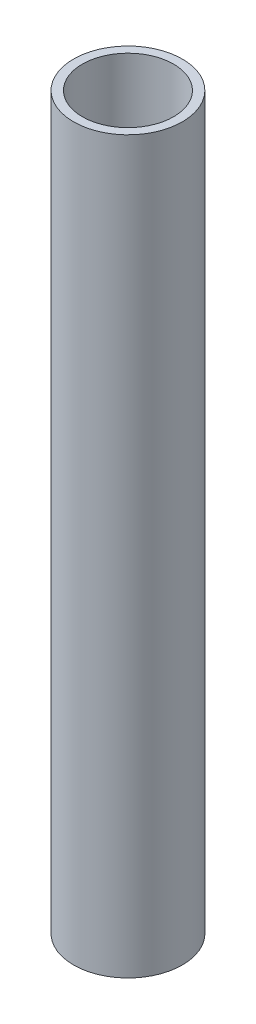
ISO-10303-21;
HEADER;
FILE_DESCRIPTION(('STEP AP214'),'2;1');
FILE_NAME('part.step','',(''),(''),'','','');
FILE_SCHEMA(('AUTOMOTIVE_DESIGN { 1 0 10303 214 1 1 1 1 }'));
ENDSEC;
DATA;
#1=APPLICATION_CONTEXT('core data for automotive mechanical design processes');
#2=APPLICATION_PROTOCOL_DEFINITION('international standard','automotive_design',2000,#1);
#3=PRODUCT_CONTEXT('',#1,'mechanical');
#4=PRODUCT('Part','Part','',(#3));
#5=PRODUCT_RELATED_PRODUCT_CATEGORY('part','',(#4));
#6=PRODUCT_DEFINITION_FORMATION('','',#4);
#7=PRODUCT_DEFINITION_CONTEXT('part definition',#1,'design');
#8=PRODUCT_DEFINITION('design','',#6,#7);
#9=PRODUCT_DEFINITION_SHAPE('','',#8);
#10=(LENGTH_UNIT() NAMED_UNIT(*) SI_UNIT(.MILLI.,.METRE.));
#11=(NAMED_UNIT(*) PLANE_ANGLE_UNIT() SI_UNIT($,.RADIAN.));
#12=(NAMED_UNIT(*) SI_UNIT($,.STERADIAN.) SOLID_ANGLE_UNIT());
#13=UNCERTAINTY_MEASURE_WITH_UNIT(LENGTH_MEASURE(1.E-05),#10,'distance_accuracy_value','');
#14=(GEOMETRIC_REPRESENTATION_CONTEXT(3) GLOBAL_UNCERTAINTY_ASSIGNED_CONTEXT((#13)) GLOBAL_UNIT_ASSIGNED_CONTEXT((#10,
#11,#12)) REPRESENTATION_CONTEXT('',''));
#15=CARTESIAN_POINT('',(0.,0.,0.));
#16=DIRECTION('',(0.,0.,1.));
#17=DIRECTION('',(1.,0.,0.));
#18=AXIS2_PLACEMENT_3D('',#15,#16,#17);
#19=CARTESIAN_POINT('',(0.,63.5,0.));
#20=DIRECTION('',(0.,1.,0.));
#21=DIRECTION('',(0.,0.,1.));
#22=AXIS2_PLACEMENT_3D('',#19,#20,#21);
#23=PLANE('',#22);
#24=CARTESIAN_POINT('',(0.,63.5,0.));
#25=DIRECTION('',(0.,1.,0.));
#26=DIRECTION('',(0.,0.,1.));
#27=AXIS2_PLACEMENT_3D('',#24,#25,#26);
#28=CIRCLE('',#27,9.4615);
#29=CARTESIAN_POINT('',(0.,63.5,9.4615));
#30=VERTEX_POINT('',#29);
#31=EDGE_CURVE('E10',#30,#30,#28,.T.);
#32=ORIENTED_EDGE('',*,*,#31,.T.);
#33=EDGE_LOOP('',(#32));
#34=FACE_BOUND('',#33,.T.);
#35=CARTESIAN_POINT('',(0.,63.5,0.));
#36=DIRECTION('',(0.,1.,0.));
#37=DIRECTION('',(0.,0.,1.));
#38=AXIS2_PLACEMENT_3D('',#35,#36,#37);
#39=CIRCLE('',#38,7.9375);
#40=CARTESIAN_POINT('',(0.,63.5,7.9375));
#41=VERTEX_POINT('',#40);
#42=EDGE_CURVE('E42',#41,#41,#39,.T.);
#43=ORIENTED_EDGE('',*,*,#42,.F.);
#44=EDGE_LOOP('',(#43));
#45=FACE_BOUND('',#44,.T.);
#46=ADVANCED_FACE('F31',(#34,#45),#23,.T.);
#47=CARTESIAN_POINT('',(0.,-63.5,0.));
#48=DIRECTION('',(0.,1.,0.));
#49=DIRECTION('',(0.,0.,1.));
#50=AXIS2_PLACEMENT_3D('',#47,#48,#49);
#51=PLANE('',#50);
#52=CARTESIAN_POINT('',(0.,-63.5,0.));
#53=DIRECTION('',(0.,1.,0.));
#54=DIRECTION('',(0.,0.,1.));
#55=AXIS2_PLACEMENT_3D('',#52,#53,#54);
#56=CIRCLE('',#55,9.4615);
#57=CARTESIAN_POINT('',(0.,-63.5,9.4615));
#58=VERTEX_POINT('',#57);
#59=EDGE_CURVE('E35',#58,#58,#56,.T.);
#60=ORIENTED_EDGE('',*,*,#59,.F.);
#61=EDGE_LOOP('',(#60));
#62=FACE_BOUND('',#61,.T.);
#63=CARTESIAN_POINT('',(0.,-63.5,0.));
#64=DIRECTION('',(0.,1.,0.));
#65=DIRECTION('',(0.,0.,1.));
#66=AXIS2_PLACEMENT_3D('',#63,#64,#65);
#67=CIRCLE('',#66,7.9375);
#68=CARTESIAN_POINT('',(0.,-63.5,7.9375));
#69=VERTEX_POINT('',#68);
#70=EDGE_CURVE('E44',#69,#69,#67,.T.);
#71=ORIENTED_EDGE('',*,*,#70,.T.);
#72=EDGE_LOOP('',(#71));
#73=FACE_BOUND('',#72,.T.);
#74=ADVANCED_FACE('F54',(#62,#73),#51,.F.);
#75=CARTESIAN_POINT('',(0.,63.5,0.));
#76=DIRECTION('',(0.,-1.,0.));
#77=DIRECTION('',(0.,0.,-1.));
#78=AXIS2_PLACEMENT_3D('',#75,#76,#77);
#79=CYLINDRICAL_SURFACE('',#78,9.4615);
#80=ORIENTED_EDGE('',*,*,#31,.F.);
#81=EDGE_LOOP('',(#80));
#82=FACE_BOUND('',#81,.T.);
#83=ORIENTED_EDGE('',*,*,#59,.T.);
#84=EDGE_LOOP('',(#83));
#85=FACE_BOUND('',#84,.T.);
#86=ADVANCED_FACE('F33',(#82,#85),#79,.T.);
#87=CARTESIAN_POINT('',(0.,63.5,0.));
#88=DIRECTION('',(0.,-1.,0.));
#89=DIRECTION('',(0.,0.,-1.));
#90=AXIS2_PLACEMENT_3D('',#87,#88,#89);
#91=CYLINDRICAL_SURFACE('',#90,7.9375);
#92=ORIENTED_EDGE('',*,*,#42,.T.);
#93=EDGE_LOOP('',(#92));
#94=FACE_BOUND('',#93,.T.);
#95=ORIENTED_EDGE('',*,*,#70,.F.);
#96=EDGE_LOOP('',(#95));
#97=FACE_BOUND('',#96,.T.);
#98=ADVANCED_FACE('F50',(#94,#97),#91,.F.);
#99=CLOSED_SHELL('',(#46,#74,#86,#98));
#100=MANIFOLD_SOLID_BREP('B2',#99);
#101=ADVANCED_BREP_SHAPE_REPRESENTATION('',(#18,#100),#14);
#102=SHAPE_DEFINITION_REPRESENTATION(#9,#101);
ENDSEC;
END-ISO-10303-21;
